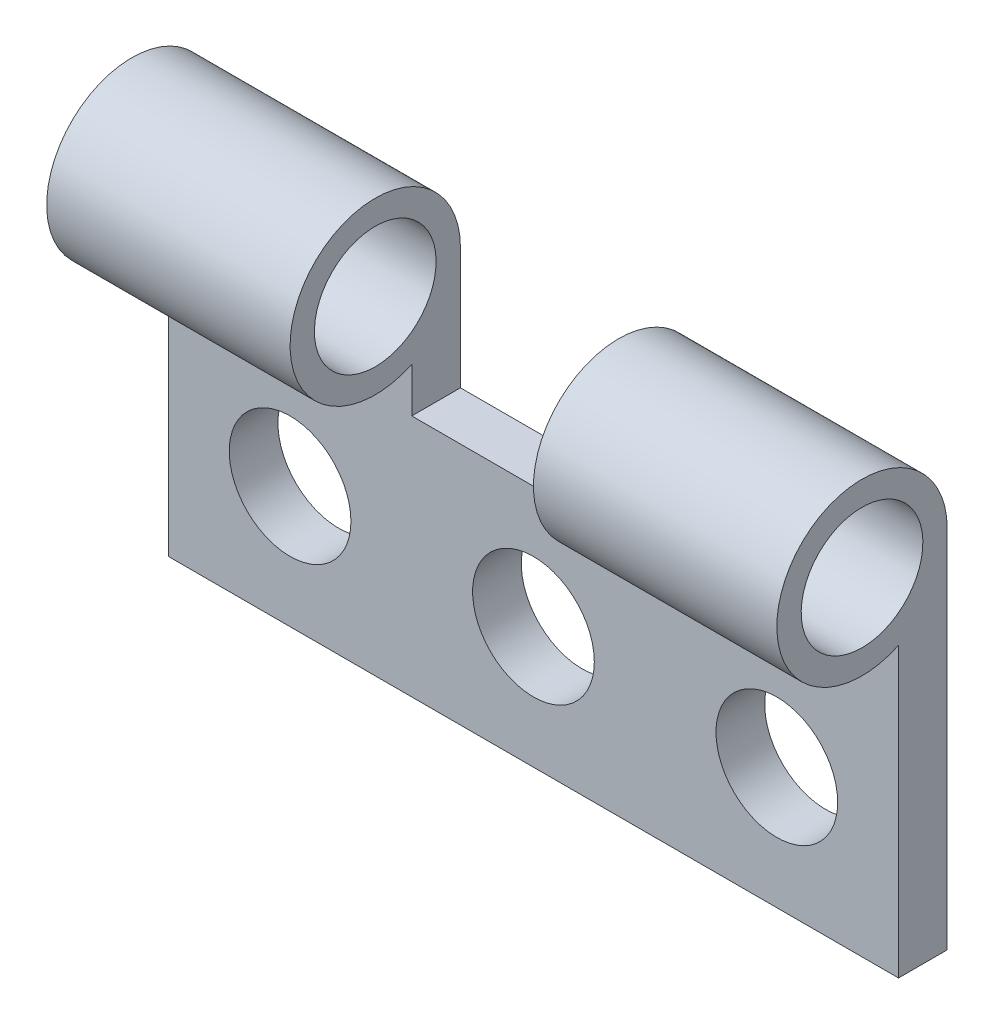
ISO-10303-21;
HEADER;
FILE_DESCRIPTION(('STEP AP214'),'2;1');
FILE_NAME('part.step','',(''),(''),'','','');
FILE_SCHEMA(('AUTOMOTIVE_DESIGN { 1 0 10303 214 1 1 1 1 }'));
ENDSEC;
DATA;
#1=APPLICATION_CONTEXT('core data for automotive mechanical design processes');
#2=APPLICATION_PROTOCOL_DEFINITION('international standard','automotive_design',2000,#1);
#3=PRODUCT_CONTEXT('',#1,'mechanical');
#4=PRODUCT('Part','Part','',(#3));
#5=PRODUCT_RELATED_PRODUCT_CATEGORY('part','',(#4));
#6=PRODUCT_DEFINITION_FORMATION('','',#4);
#7=PRODUCT_DEFINITION_CONTEXT('part definition',#1,'design');
#8=PRODUCT_DEFINITION('design','',#6,#7);
#9=PRODUCT_DEFINITION_SHAPE('','',#8);
#10=(LENGTH_UNIT() NAMED_UNIT(*) SI_UNIT(.MILLI.,.METRE.));
#11=(NAMED_UNIT(*) PLANE_ANGLE_UNIT() SI_UNIT($,.RADIAN.));
#12=(NAMED_UNIT(*) SI_UNIT($,.STERADIAN.) SOLID_ANGLE_UNIT());
#13=UNCERTAINTY_MEASURE_WITH_UNIT(LENGTH_MEASURE(1.E-05),#10,'distance_accuracy_value','');
#14=(GEOMETRIC_REPRESENTATION_CONTEXT(3) GLOBAL_UNCERTAINTY_ASSIGNED_CONTEXT((#13)) GLOBAL_UNIT_ASSIGNED_CONTEXT((#10,
#11,#12)) REPRESENTATION_CONTEXT('',''));
#15=CARTESIAN_POINT('',(0.,0.,0.));
#16=DIRECTION('',(0.,0.,1.));
#17=DIRECTION('',(1.,0.,0.));
#18=AXIS2_PLACEMENT_3D('',#15,#16,#17);
#19=CARTESIAN_POINT('',(15.,5.,2.));
#20=DIRECTION('',(-1.,0.,0.));
#21=DIRECTION('',(0.,0.,1.));
#22=AXIS2_PLACEMENT_3D('',#19,#20,#21);
#23=PLANE('',#22);
#24=DIRECTION('',(0.,1.,0.));
#25=VECTOR('',#24,1.);
#26=CARTESIAN_POINT('',(15.,5.,0.));
#27=LINE('',#26,#25);
#28=CARTESIAN_POINT('',(15.,-5.,0.));
#29=VERTEX_POINT('',#28);
#30=CARTESIAN_POINT('',(15.,10.,0.));
#31=VERTEX_POINT('',#30);
#32=EDGE_CURVE('E125',#29,#31,#27,.T.);
#33=ORIENTED_EDGE('',*,*,#32,.T.);
#34=CARTESIAN_POINT('',(15.,10.,3.5));
#35=DIRECTION('',(-1.,0.,0.));
#36=DIRECTION('',(0.,-1.,0.));
#37=AXIS2_PLACEMENT_3D('',#34,#35,#36);
#38=CIRCLE('',#37,3.5);
#39=CARTESIAN_POINT('',(15.,6.83772233983162,2.));
#40=VERTEX_POINT('',#39);
#41=EDGE_CURVE('E117',#40,#31,#38,.T.);
#42=ORIENTED_EDGE('',*,*,#41,.F.);
#43=DIRECTION('',(0.,1.,0.));
#44=VECTOR('',#43,1.);
#45=CARTESIAN_POINT('',(15.,5.,2.));
#46=LINE('',#45,#44);
#47=CARTESIAN_POINT('',(15.,-5.,2.));
#48=VERTEX_POINT('',#47);
#49=EDGE_CURVE('E101',#48,#40,#46,.T.);
#50=ORIENTED_EDGE('',*,*,#49,.F.);
#51=DIRECTION('',(0.,0.,-1.));
#52=VECTOR('',#51,1.);
#53=CARTESIAN_POINT('',(15.,-5.,2.));
#54=LINE('',#53,#52);
#55=EDGE_CURVE('E45',#48,#29,#54,.T.);
#56=ORIENTED_EDGE('',*,*,#55,.T.);
#57=EDGE_LOOP('',(#33,#42,#50,#56));
#58=FACE_BOUND('',#57,.T.);
#59=CARTESIAN_POINT('',(15.,10.,3.5));
#60=DIRECTION('',(-1.,0.,0.));
#61=DIRECTION('',(0.,-1.,0.));
#62=AXIS2_PLACEMENT_3D('',#59,#60,#61);
#63=CIRCLE('',#62,2.5);
#64=CARTESIAN_POINT('',(15.,7.5,3.5));
#65=VERTEX_POINT('',#64);
#66=EDGE_CURVE('E139',#65,#65,#63,.T.);
#67=ORIENTED_EDGE('',*,*,#66,.T.);
#68=EDGE_LOOP('',(#67));
#69=FACE_BOUND('',#68,.T.);
#70=ADVANCED_FACE('F37',(#58,#69),#23,.F.);
#71=CARTESIAN_POINT('',(-15.,5.,2.));
#72=DIRECTION('',(0.,-1.,0.));
#73=DIRECTION('',(0.,0.,-1.));
#74=AXIS2_PLACEMENT_3D('',#71,#72,#73);
#75=PLANE('',#74);
#76=DIRECTION('',(-1.,0.,0.));
#77=VECTOR('',#76,1.);
#78=CARTESIAN_POINT('',(-15.,5.,2.));
#79=LINE('',#78,#77);
#80=CARTESIAN_POINT('',(5.,5.,2.));
#81=VERTEX_POINT('',#80);
#82=CARTESIAN_POINT('',(-5.,5.,2.));
#83=VERTEX_POINT('',#82);
#84=EDGE_CURVE('E53',#81,#83,#79,.T.);
#85=ORIENTED_EDGE('',*,*,#84,.F.);
#86=DIRECTION('',(0.,0.,1.));
#87=VECTOR('',#86,1.);
#88=CARTESIAN_POINT('',(5.,5.,0.));
#89=LINE('',#88,#87);
#90=CARTESIAN_POINT('',(5.,5.,0.));
#91=VERTEX_POINT('',#90);
#92=EDGE_CURVE('E135',#91,#81,#89,.T.);
#93=ORIENTED_EDGE('',*,*,#92,.F.);
#94=DIRECTION('',(-1.,0.,0.));
#95=VECTOR('',#94,1.);
#96=CARTESIAN_POINT('',(-15.,5.,0.));
#97=LINE('',#96,#95);
#98=CARTESIAN_POINT('',(-4.99999999999999,5.,0.));
#99=VERTEX_POINT('',#98);
#100=EDGE_CURVE('E173',#91,#99,#97,.T.);
#101=ORIENTED_EDGE('',*,*,#100,.T.);
#102=DIRECTION('',(0.,0.,1.));
#103=VECTOR('',#102,1.);
#104=CARTESIAN_POINT('',(-4.99999999999999,5.,0.));
#105=LINE('',#104,#103);
#106=EDGE_CURVE('E150',#99,#83,#105,.T.);
#107=ORIENTED_EDGE('',*,*,#106,.T.);
#108=EDGE_LOOP('',(#85,#93,#101,#107));
#109=FACE_BOUND('',#108,.T.);
#110=ADVANCED_FACE('F232',(#109),#75,.F.);
#111=CARTESIAN_POINT('',(-15.,5.,2.));
#112=DIRECTION('',(1.,0.,0.));
#113=DIRECTION('',(0.,1.,0.));
#114=AXIS2_PLACEMENT_3D('',#111,#112,#113);
#115=PLANE('',#114);
#116=DIRECTION('',(0.,-1.,0.));
#117=VECTOR('',#116,1.);
#118=CARTESIAN_POINT('',(-15.,5.,0.));
#119=LINE('',#118,#117);
#120=CARTESIAN_POINT('',(-15.,10.,0.));
#121=VERTEX_POINT('',#120);
#122=CARTESIAN_POINT('',(-15.,-5.,0.));
#123=VERTEX_POINT('',#122);
#124=EDGE_CURVE('E175',#121,#123,#119,.T.);
#125=ORIENTED_EDGE('',*,*,#124,.T.);
#126=DIRECTION('',(0.,0.,-1.));
#127=VECTOR('',#126,1.);
#128=CARTESIAN_POINT('',(-15.,-5.,2.));
#129=LINE('',#128,#127);
#130=CARTESIAN_POINT('',(-15.,-5.,2.));
#131=VERTEX_POINT('',#130);
#132=EDGE_CURVE('E11',#131,#123,#129,.T.);
#133=ORIENTED_EDGE('',*,*,#132,.F.);
#134=DIRECTION('',(0.,-1.,0.));
#135=VECTOR('',#134,1.);
#136=CARTESIAN_POINT('',(-15.,5.,2.));
#137=LINE('',#136,#135);
#138=CARTESIAN_POINT('',(-15.,6.83772233983162,2.));
#139=VERTEX_POINT('',#138);
#140=EDGE_CURVE('E169',#139,#131,#137,.T.);
#141=ORIENTED_EDGE('',*,*,#140,.F.);
#142=CARTESIAN_POINT('',(-15.,10.,3.5));
#143=DIRECTION('',(-1.,0.,0.));
#144=DIRECTION('',(0.,-1.,0.));
#145=AXIS2_PLACEMENT_3D('',#142,#143,#144);
#146=CIRCLE('',#145,3.5);
#147=EDGE_CURVE('E147',#139,#121,#146,.T.);
#148=ORIENTED_EDGE('',*,*,#147,.T.);
#149=EDGE_LOOP('',(#125,#133,#141,#148));
#150=FACE_BOUND('',#149,.T.);
#151=CARTESIAN_POINT('',(-15.,10.,3.5));
#152=DIRECTION('',(-1.,0.,0.));
#153=DIRECTION('',(0.,-1.,0.));
#154=AXIS2_PLACEMENT_3D('',#151,#152,#153);
#155=CIRCLE('',#154,2.5);
#156=CARTESIAN_POINT('',(-15.,7.5,3.5));
#157=VERTEX_POINT('',#156);
#158=EDGE_CURVE('E142',#157,#157,#155,.T.);
#159=ORIENTED_EDGE('',*,*,#158,.F.);
#160=EDGE_LOOP('',(#159));
#161=FACE_BOUND('',#160,.T.);
#162=ADVANCED_FACE('F242',(#150,#161),#115,.F.);
#163=CARTESIAN_POINT('',(-15.,-5.,2.));
#164=DIRECTION('',(0.,1.,0.));
#165=DIRECTION('',(0.,0.,1.));
#166=AXIS2_PLACEMENT_3D('',#163,#164,#165);
#167=PLANE('',#166);
#168=DIRECTION('',(1.,0.,0.));
#169=VECTOR('',#168,1.);
#170=CARTESIAN_POINT('',(-15.,-5.,0.));
#171=LINE('',#170,#169);
#172=EDGE_CURVE('E112',#123,#29,#171,.T.);
#173=ORIENTED_EDGE('',*,*,#172,.T.);
#174=ORIENTED_EDGE('',*,*,#55,.F.);
#175=DIRECTION('',(1.,0.,0.));
#176=VECTOR('',#175,1.);
#177=CARTESIAN_POINT('',(-15.,-5.,2.));
#178=LINE('',#177,#176);
#179=EDGE_CURVE('E107',#131,#48,#178,.T.);
#180=ORIENTED_EDGE('',*,*,#179,.F.);
#181=ORIENTED_EDGE('',*,*,#132,.T.);
#182=EDGE_LOOP('',(#173,#174,#180,#181));
#183=FACE_BOUND('',#182,.T.);
#184=ADVANCED_FACE('F210',(#183),#167,.F.);
#185=CARTESIAN_POINT('',(0.,0.,2.));
#186=DIRECTION('',(0.,0.,1.));
#187=DIRECTION('',(1.,0.,0.));
#188=AXIS2_PLACEMENT_3D('',#185,#186,#187);
#189=PLANE('',#188);
#190=CARTESIAN_POINT('',(-9.99999999999999,0.,2.));
#191=DIRECTION('',(0.,0.,1.));
#192=DIRECTION('',(1.,0.,0.));
#193=AXIS2_PLACEMENT_3D('',#190,#191,#192);
#194=CIRCLE('',#193,2.5);
#195=CARTESIAN_POINT('',(-7.49999999999999,0.,2.));
#196=VERTEX_POINT('',#195);
#197=EDGE_CURVE('E182',#196,#196,#194,.T.);
#198=ORIENTED_EDGE('',*,*,#197,.F.);
#199=EDGE_LOOP('',(#198));
#200=FACE_BOUND('',#199,.T.);
#201=CARTESIAN_POINT('',(0.,0.,2.));
#202=DIRECTION('',(0.,0.,1.));
#203=DIRECTION('',(1.,0.,0.));
#204=AXIS2_PLACEMENT_3D('',#201,#202,#203);
#205=CIRCLE('',#204,2.5);
#206=CARTESIAN_POINT('',(2.50000000000001,0.,2.));
#207=VERTEX_POINT('',#206);
#208=EDGE_CURVE('E198',#207,#207,#205,.T.);
#209=ORIENTED_EDGE('',*,*,#208,.F.);
#210=EDGE_LOOP('',(#209));
#211=FACE_BOUND('',#210,.T.);
#212=CARTESIAN_POINT('',(10.,0.,2.));
#213=DIRECTION('',(0.,0.,1.));
#214=DIRECTION('',(1.,0.,0.));
#215=AXIS2_PLACEMENT_3D('',#212,#213,#214);
#216=CIRCLE('',#215,2.5);
#217=CARTESIAN_POINT('',(12.5,0.,2.));
#218=VERTEX_POINT('',#217);
#219=EDGE_CURVE('E195',#218,#218,#216,.T.);
#220=ORIENTED_EDGE('',*,*,#219,.F.);
#221=EDGE_LOOP('',(#220));
#222=FACE_BOUND('',#221,.T.);
#223=ORIENTED_EDGE('',*,*,#49,.T.);
#224=DIRECTION('',(-1.,0.,0.));
#225=VECTOR('',#224,1.);
#226=CARTESIAN_POINT('',(15.,6.83772233983162,2.));
#227=LINE('',#226,#225);
#228=CARTESIAN_POINT('',(5.,6.83772233983162,2.));
#229=VERTEX_POINT('',#228);
#230=EDGE_CURVE('E104',#40,#229,#227,.T.);
#231=ORIENTED_EDGE('',*,*,#230,.T.);
#232=DIRECTION('',(0.,1.,0.));
#233=VECTOR('',#232,1.);
#234=CARTESIAN_POINT('',(5.,5.,2.));
#235=LINE('',#234,#233);
#236=EDGE_CURVE('E138',#81,#229,#235,.T.);
#237=ORIENTED_EDGE('',*,*,#236,.F.);
#238=ORIENTED_EDGE('',*,*,#84,.T.);
#239=DIRECTION('',(0.,1.,0.));
#240=VECTOR('',#239,1.);
#241=CARTESIAN_POINT('',(-4.99999999999999,5.,2.));
#242=LINE('',#241,#240);
#243=CARTESIAN_POINT('',(-5.,6.83772233983162,2.));
#244=VERTEX_POINT('',#243);
#245=EDGE_CURVE('E152',#83,#244,#242,.T.);
#246=ORIENTED_EDGE('',*,*,#245,.T.);
#247=DIRECTION('',(-1.,0.,0.));
#248=VECTOR('',#247,1.);
#249=CARTESIAN_POINT('',(-5.,6.83772233983162,2.));
#250=LINE('',#249,#248);
#251=EDGE_CURVE('E160',#244,#139,#250,.T.);
#252=ORIENTED_EDGE('',*,*,#251,.T.);
#253=ORIENTED_EDGE('',*,*,#140,.T.);
#254=ORIENTED_EDGE('',*,*,#179,.T.);
#255=EDGE_LOOP('',(#223,#231,#237,#238,#246,#252,#253,#254));
#256=FACE_BOUND('',#255,.T.);
#257=ADVANCED_FACE('F103',(#200,#211,#222,#256),#189,.T.);
#258=CARTESIAN_POINT('',(0.,0.,0.));
#259=DIRECTION('',(0.,0.,1.));
#260=DIRECTION('',(1.,0.,0.));
#261=AXIS2_PLACEMENT_3D('',#258,#259,#260);
#262=PLANE('',#261);
#263=CARTESIAN_POINT('',(-9.99999999999999,0.,0.));
#264=DIRECTION('',(0.,0.,1.));
#265=DIRECTION('',(1.,0.,0.));
#266=AXIS2_PLACEMENT_3D('',#263,#264,#265);
#267=CIRCLE('',#266,2.5);
#268=CARTESIAN_POINT('',(-7.49999999999999,0.,0.));
#269=VERTEX_POINT('',#268);
#270=EDGE_CURVE('E40',#269,#269,#267,.T.);
#271=ORIENTED_EDGE('',*,*,#270,.T.);
#272=EDGE_LOOP('',(#271));
#273=FACE_BOUND('',#272,.T.);
#274=CARTESIAN_POINT('',(0.,0.,0.));
#275=DIRECTION('',(0.,0.,1.));
#276=DIRECTION('',(1.,0.,0.));
#277=AXIS2_PLACEMENT_3D('',#274,#275,#276);
#278=CIRCLE('',#277,2.5);
#279=CARTESIAN_POINT('',(2.50000000000001,0.,0.));
#280=VERTEX_POINT('',#279);
#281=EDGE_CURVE('E181',#280,#280,#278,.T.);
#282=ORIENTED_EDGE('',*,*,#281,.T.);
#283=EDGE_LOOP('',(#282));
#284=FACE_BOUND('',#283,.T.);
#285=CARTESIAN_POINT('',(10.,0.,0.));
#286=DIRECTION('',(0.,0.,1.));
#287=DIRECTION('',(1.,0.,0.));
#288=AXIS2_PLACEMENT_3D('',#285,#286,#287);
#289=CIRCLE('',#288,2.5);
#290=CARTESIAN_POINT('',(12.5,0.,0.));
#291=VERTEX_POINT('',#290);
#292=EDGE_CURVE('E179',#291,#291,#289,.T.);
#293=ORIENTED_EDGE('',*,*,#292,.T.);
#294=EDGE_LOOP('',(#293));
#295=FACE_BOUND('',#294,.T.);
#296=ORIENTED_EDGE('',*,*,#32,.F.);
#297=ORIENTED_EDGE('',*,*,#172,.F.);
#298=ORIENTED_EDGE('',*,*,#124,.F.);
#299=DIRECTION('',(-1.,0.,0.));
#300=VECTOR('',#299,1.);
#301=CARTESIAN_POINT('',(-4.99999999999999,10.,0.));
#302=LINE('',#301,#300);
#303=CARTESIAN_POINT('',(-4.99999999999999,10.,0.));
#304=VERTEX_POINT('',#303);
#305=EDGE_CURVE('E163',#304,#121,#302,.T.);
#306=ORIENTED_EDGE('',*,*,#305,.F.);
#307=DIRECTION('',(0.,-1.,0.));
#308=VECTOR('',#307,1.);
#309=CARTESIAN_POINT('',(-4.99999999999999,5.,0.));
#310=LINE('',#309,#308);
#311=EDGE_CURVE('E157',#304,#99,#310,.T.);
#312=ORIENTED_EDGE('',*,*,#311,.T.);
#313=ORIENTED_EDGE('',*,*,#100,.F.);
#314=DIRECTION('',(0.,-1.,0.));
#315=VECTOR('',#314,1.);
#316=CARTESIAN_POINT('',(5.,5.,0.));
#317=LINE('',#316,#315);
#318=CARTESIAN_POINT('',(5.,10.,0.));
#319=VERTEX_POINT('',#318);
#320=EDGE_CURVE('E127',#319,#91,#317,.T.);
#321=ORIENTED_EDGE('',*,*,#320,.F.);
#322=DIRECTION('',(-1.,0.,0.));
#323=VECTOR('',#322,1.);
#324=CARTESIAN_POINT('',(15.,10.,0.));
#325=LINE('',#324,#323);
#326=EDGE_CURVE('E121',#31,#319,#325,.T.);
#327=ORIENTED_EDGE('',*,*,#326,.F.);
#328=EDGE_LOOP('',(#296,#297,#298,#306,#312,#313,#321,#327));
#329=FACE_BOUND('',#328,.T.);
#330=ADVANCED_FACE('F209',(#273,#284,#295,#329),#262,.F.);
#331=CARTESIAN_POINT('',(-5.,10.,3.5));
#332=DIRECTION('',(-1.,0.,0.));
#333=DIRECTION('',(0.,-1.,0.));
#334=AXIS2_PLACEMENT_3D('',#331,#332,#333);
#335=CYLINDRICAL_SURFACE('',#334,3.5);
#336=ORIENTED_EDGE('',*,*,#147,.F.);
#337=ORIENTED_EDGE('',*,*,#251,.F.);
#338=CARTESIAN_POINT('',(-5.,10.,3.5));
#339=DIRECTION('',(-1.,0.,0.));
#340=DIRECTION('',(0.,-1.,0.));
#341=AXIS2_PLACEMENT_3D('',#338,#339,#340);
#342=CIRCLE('',#341,3.5);
#343=EDGE_CURVE('E154',#244,#304,#342,.T.);
#344=ORIENTED_EDGE('',*,*,#343,.T.);
#345=ORIENTED_EDGE('',*,*,#305,.T.);
#346=EDGE_LOOP('',(#336,#337,#344,#345));
#347=FACE_BOUND('',#346,.T.);
#348=ADVANCED_FACE('F226',(#347),#335,.T.);
#349=CARTESIAN_POINT('',(-5.,10.,3.5));
#350=DIRECTION('',(-1.,0.,0.));
#351=DIRECTION('',(0.,-1.,0.));
#352=AXIS2_PLACEMENT_3D('',#349,#350,#351);
#353=PLANE('',#352);
#354=CARTESIAN_POINT('',(-5.,10.,3.5));
#355=DIRECTION('',(-1.,0.,0.));
#356=DIRECTION('',(0.,-1.,0.));
#357=AXIS2_PLACEMENT_3D('',#354,#355,#356);
#358=CIRCLE('',#357,2.5);
#359=CARTESIAN_POINT('',(-5.,7.5,3.5));
#360=VERTEX_POINT('',#359);
#361=EDGE_CURVE('E144',#360,#360,#358,.T.);
#362=ORIENTED_EDGE('',*,*,#361,.T.);
#363=EDGE_LOOP('',(#362));
#364=FACE_BOUND('',#363,.T.);
#365=ORIENTED_EDGE('',*,*,#106,.F.);
#366=ORIENTED_EDGE('',*,*,#311,.F.);
#367=ORIENTED_EDGE('',*,*,#343,.F.);
#368=ORIENTED_EDGE('',*,*,#245,.F.);
#369=EDGE_LOOP('',(#365,#366,#367,#368));
#370=FACE_BOUND('',#369,.T.);
#371=ADVANCED_FACE('F236',(#364,#370),#353,.F.);
#372=CARTESIAN_POINT('',(-5.,10.,3.5));
#373=DIRECTION('',(-1.,0.,0.));
#374=DIRECTION('',(0.,-1.,0.));
#375=AXIS2_PLACEMENT_3D('',#372,#373,#374);
#376=CYLINDRICAL_SURFACE('',#375,2.5);
#377=ORIENTED_EDGE('',*,*,#361,.F.);
#378=EDGE_LOOP('',(#377));
#379=FACE_BOUND('',#378,.T.);
#380=ORIENTED_EDGE('',*,*,#158,.T.);
#381=EDGE_LOOP('',(#380));
#382=FACE_BOUND('',#381,.T.);
#383=ADVANCED_FACE('F286',(#379,#382),#376,.F.);
#384=CARTESIAN_POINT('',(15.,10.,3.5));
#385=DIRECTION('',(-1.,0.,0.));
#386=DIRECTION('',(0.,-1.,0.));
#387=AXIS2_PLACEMENT_3D('',#384,#385,#386);
#388=CYLINDRICAL_SURFACE('',#387,3.5);
#389=CARTESIAN_POINT('',(5.,10.,3.5));
#390=DIRECTION('',(-1.,0.,0.));
#391=DIRECTION('',(0.,-1.,0.));
#392=AXIS2_PLACEMENT_3D('',#389,#390,#391);
#393=CIRCLE('',#392,3.5);
#394=EDGE_CURVE('E119',#229,#319,#393,.T.);
#395=ORIENTED_EDGE('',*,*,#394,.F.);
#396=ORIENTED_EDGE('',*,*,#230,.F.);
#397=ORIENTED_EDGE('',*,*,#41,.T.);
#398=ORIENTED_EDGE('',*,*,#326,.T.);
#399=EDGE_LOOP('',(#395,#396,#397,#398));
#400=FACE_BOUND('',#399,.T.);
#401=ADVANCED_FACE('F116',(#400),#388,.T.);
#402=CARTESIAN_POINT('',(5.,10.,3.5));
#403=DIRECTION('',(-1.,0.,0.));
#404=DIRECTION('',(0.,-1.,0.));
#405=AXIS2_PLACEMENT_3D('',#402,#403,#404);
#406=PLANE('',#405);
#407=CARTESIAN_POINT('',(5.,10.,3.5));
#408=DIRECTION('',(-1.,0.,0.));
#409=DIRECTION('',(0.,-1.,0.));
#410=AXIS2_PLACEMENT_3D('',#407,#408,#409);
#411=CIRCLE('',#410,2.5);
#412=CARTESIAN_POINT('',(5.,7.5,3.5));
#413=VERTEX_POINT('',#412);
#414=EDGE_CURVE('E133',#413,#413,#411,.T.);
#415=ORIENTED_EDGE('',*,*,#414,.F.);
#416=EDGE_LOOP('',(#415));
#417=FACE_BOUND('',#416,.T.);
#418=ORIENTED_EDGE('',*,*,#92,.T.);
#419=ORIENTED_EDGE('',*,*,#236,.T.);
#420=ORIENTED_EDGE('',*,*,#394,.T.);
#421=ORIENTED_EDGE('',*,*,#320,.T.);
#422=EDGE_LOOP('',(#418,#419,#420,#421));
#423=FACE_BOUND('',#422,.T.);
#424=ADVANCED_FACE('F231',(#417,#423),#406,.T.);
#425=CARTESIAN_POINT('',(15.,10.,3.5));
#426=DIRECTION('',(-1.,0.,0.));
#427=DIRECTION('',(0.,-1.,0.));
#428=AXIS2_PLACEMENT_3D('',#425,#426,#427);
#429=CYLINDRICAL_SURFACE('',#428,2.5);
#430=ORIENTED_EDGE('',*,*,#66,.F.);
#431=EDGE_LOOP('',(#430));
#432=FACE_BOUND('',#431,.T.);
#433=ORIENTED_EDGE('',*,*,#414,.T.);
#434=EDGE_LOOP('',(#433));
#435=FACE_BOUND('',#434,.T.);
#436=ADVANCED_FACE('F220',(#432,#435),#429,.F.);
#437=CARTESIAN_POINT('',(10.,0.,-8.));
#438=DIRECTION('',(0.,0.,1.));
#439=DIRECTION('',(1.,0.,0.));
#440=AXIS2_PLACEMENT_3D('',#437,#438,#439);
#441=CYLINDRICAL_SURFACE('',#440,2.5);
#442=ORIENTED_EDGE('',*,*,#219,.T.);
#443=EDGE_LOOP('',(#442));
#444=FACE_BOUND('',#443,.T.);
#445=ORIENTED_EDGE('',*,*,#292,.F.);
#446=EDGE_LOOP('',(#445));
#447=FACE_BOUND('',#446,.T.);
#448=ADVANCED_FACE('F216',(#444,#447),#441,.F.);
#449=CARTESIAN_POINT('',(0.,0.,-8.));
#450=DIRECTION('',(0.,0.,1.));
#451=DIRECTION('',(1.,0.,0.));
#452=AXIS2_PLACEMENT_3D('',#449,#450,#451);
#453=CYLINDRICAL_SURFACE('',#452,2.5);
#454=ORIENTED_EDGE('',*,*,#208,.T.);
#455=EDGE_LOOP('',(#454));
#456=FACE_BOUND('',#455,.T.);
#457=ORIENTED_EDGE('',*,*,#281,.F.);
#458=EDGE_LOOP('',(#457));
#459=FACE_BOUND('',#458,.T.);
#460=ADVANCED_FACE('F219',(#456,#459),#453,.F.);
#461=CARTESIAN_POINT('',(-9.99999999999999,0.,-8.));
#462=DIRECTION('',(0.,0.,1.));
#463=DIRECTION('',(1.,0.,0.));
#464=AXIS2_PLACEMENT_3D('',#461,#462,#463);
#465=CYLINDRICAL_SURFACE('',#464,2.5);
#466=ORIENTED_EDGE('',*,*,#197,.T.);
#467=EDGE_LOOP('',(#466));
#468=FACE_BOUND('',#467,.T.);
#469=ORIENTED_EDGE('',*,*,#270,.F.);
#470=EDGE_LOOP('',(#469));
#471=FACE_BOUND('',#470,.T.);
#472=ADVANCED_FACE('F204',(#468,#471),#465,.F.);
#473=CLOSED_SHELL('',(#70,#110,#162,#184,#257,#330,#348,#371,#383,#401,#424,#436,#448,#460,#472));
#474=MANIFOLD_SOLID_BREP('B2',#473);
#475=ADVANCED_BREP_SHAPE_REPRESENTATION('',(#18,#474),#14);
#476=SHAPE_DEFINITION_REPRESENTATION(#9,#475);
ENDSEC;
END-ISO-10303-21;
